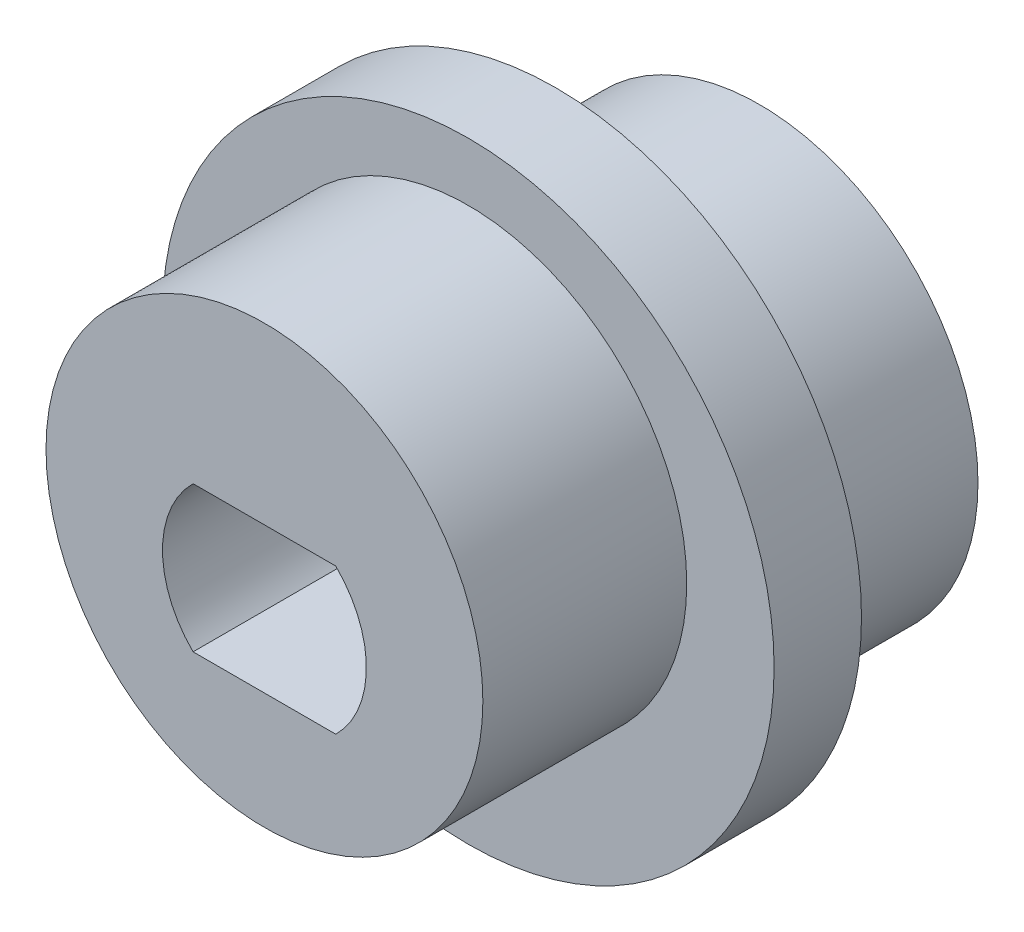
ISO-10303-21;
HEADER;
FILE_DESCRIPTION(('STEP AP214'),'2;1');
FILE_NAME('part.step','',(''),(''),'','','');
FILE_SCHEMA(('AUTOMOTIVE_DESIGN { 1 0 10303 214 1 1 1 1 }'));
ENDSEC;
DATA;
#1=APPLICATION_CONTEXT('core data for automotive mechanical design processes');
#2=APPLICATION_PROTOCOL_DEFINITION('international standard','automotive_design',2000,#1);
#3=PRODUCT_CONTEXT('',#1,'mechanical');
#4=PRODUCT('Part','Part','',(#3));
#5=PRODUCT_RELATED_PRODUCT_CATEGORY('part','',(#4));
#6=PRODUCT_DEFINITION_FORMATION('','',#4);
#7=PRODUCT_DEFINITION_CONTEXT('part definition',#1,'design');
#8=PRODUCT_DEFINITION('design','',#6,#7);
#9=PRODUCT_DEFINITION_SHAPE('','',#8);
#10=(LENGTH_UNIT() NAMED_UNIT(*) SI_UNIT(.MILLI.,.METRE.));
#11=(NAMED_UNIT(*) PLANE_ANGLE_UNIT() SI_UNIT($,.RADIAN.));
#12=(NAMED_UNIT(*) SI_UNIT($,.STERADIAN.) SOLID_ANGLE_UNIT());
#13=UNCERTAINTY_MEASURE_WITH_UNIT(LENGTH_MEASURE(1.E-05),#10,'distance_accuracy_value','');
#14=(GEOMETRIC_REPRESENTATION_CONTEXT(3) GLOBAL_UNCERTAINTY_ASSIGNED_CONTEXT((#13)) GLOBAL_UNIT_ASSIGNED_CONTEXT((#10,
#11,#12)) REPRESENTATION_CONTEXT('',''));
#15=CARTESIAN_POINT('',(0.,0.,0.));
#16=DIRECTION('',(0.,0.,1.));
#17=DIRECTION('',(1.,0.,0.));
#18=AXIS2_PLACEMENT_3D('',#15,#16,#17);
#19=CARTESIAN_POINT('',(0.,0.,0.));
#20=DIRECTION('',(0.,0.,1.));
#21=DIRECTION('',(1.,0.,0.));
#22=AXIS2_PLACEMENT_3D('',#19,#20,#21);
#23=PLANE('',#22);
#24=CARTESIAN_POINT('',(0.,0.,0.));
#25=DIRECTION('',(0.,0.,1.));
#26=DIRECTION('',(1.,0.,0.));
#27=AXIS2_PLACEMENT_3D('',#24,#25,#26);
#28=CIRCLE('',#27,7.5);
#29=CARTESIAN_POINT('',(7.5,0.,0.));
#30=VERTEX_POINT('',#29);
#31=EDGE_CURVE('E50',#30,#30,#28,.T.);
#32=ORIENTED_EDGE('',*,*,#31,.F.);
#33=EDGE_LOOP('',(#32));
#34=FACE_BOUND('',#33,.T.);
#35=DIRECTION('',(1.,0.,0.));
#36=VECTOR('',#35,1.);
#37=CARTESIAN_POINT('',(-2.44948974278318,3.5,0.));
#38=LINE('',#37,#36);
#39=CARTESIAN_POINT('',(-2.44948974278318,3.5,0.));
#40=VERTEX_POINT('',#39);
#41=CARTESIAN_POINT('',(2.44948974278318,3.5,0.));
#42=VERTEX_POINT('',#41);
#43=EDGE_CURVE('E90',#40,#42,#38,.T.);
#44=ORIENTED_EDGE('',*,*,#43,.F.);
#45=CARTESIAN_POINT('',(0.,1.,0.));
#46=DIRECTION('',(0.,0.,1.));
#47=DIRECTION('',(1.,0.,0.));
#48=AXIS2_PLACEMENT_3D('',#45,#46,#47);
#49=CIRCLE('',#48,3.5);
#50=CARTESIAN_POINT('',(-2.44948974278318,-1.5,0.));
#51=VERTEX_POINT('',#50);
#52=EDGE_CURVE('E131',#40,#51,#49,.T.);
#53=ORIENTED_EDGE('',*,*,#52,.T.);
#54=DIRECTION('',(1.,0.,0.));
#55=VECTOR('',#54,1.);
#56=CARTESIAN_POINT('',(-2.44948974278318,-1.5,0.));
#57=LINE('',#56,#55);
#58=CARTESIAN_POINT('',(2.44948974278318,-1.5,0.));
#59=VERTEX_POINT('',#58);
#60=EDGE_CURVE('E62',#51,#59,#57,.T.);
#61=ORIENTED_EDGE('',*,*,#60,.T.);
#62=CARTESIAN_POINT('',(0.,1.,0.));
#63=DIRECTION('',(0.,0.,1.));
#64=DIRECTION('',(1.,0.,0.));
#65=AXIS2_PLACEMENT_3D('',#62,#63,#64);
#66=CIRCLE('',#65,3.5);
#67=EDGE_CURVE('E126',#59,#42,#66,.T.);
#68=ORIENTED_EDGE('',*,*,#67,.T.);
#69=EDGE_LOOP('',(#44,#53,#61,#68));
#70=FACE_BOUND('',#69,.T.);
#71=ADVANCED_FACE('F46',(#34,#70),#23,.F.);
#72=CARTESIAN_POINT('',(0.,2.,17.));
#73=DIRECTION('',(0.,0.,1.));
#74=DIRECTION('',(1.,0.,0.));
#75=AXIS2_PLACEMENT_3D('',#72,#73,#74);
#76=PLANE('',#75);
#77=CARTESIAN_POINT('',(0.,2.,17.));
#78=DIRECTION('',(0.,0.,1.));
#79=DIRECTION('',(1.,0.,0.));
#80=AXIS2_PLACEMENT_3D('',#77,#78,#79);
#81=CIRCLE('',#80,7.5);
#82=CARTESIAN_POINT('',(7.5,2.,17.));
#83=VERTEX_POINT('',#82);
#84=EDGE_CURVE('E143',#83,#83,#81,.T.);
#85=ORIENTED_EDGE('',*,*,#84,.T.);
#86=EDGE_LOOP('',(#85));
#87=FACE_BOUND('',#86,.T.);
#88=CARTESIAN_POINT('',(0.,1.,17.));
#89=DIRECTION('',(0.,0.,1.));
#90=DIRECTION('',(1.,0.,0.));
#91=AXIS2_PLACEMENT_3D('',#88,#89,#90);
#92=CIRCLE('',#91,3.5);
#93=CARTESIAN_POINT('',(-2.44948974278318,3.5,17.));
#94=VERTEX_POINT('',#93);
#95=CARTESIAN_POINT('',(-2.44948974278318,-1.5,17.));
#96=VERTEX_POINT('',#95);
#97=EDGE_CURVE('E110',#94,#96,#92,.T.);
#98=ORIENTED_EDGE('',*,*,#97,.F.);
#99=DIRECTION('',(1.,0.,0.));
#100=VECTOR('',#99,1.);
#101=CARTESIAN_POINT('',(-2.44948974278318,3.5,17.));
#102=LINE('',#101,#100);
#103=CARTESIAN_POINT('',(2.44948974278318,3.5,17.));
#104=VERTEX_POINT('',#103);
#105=EDGE_CURVE('E70',#94,#104,#102,.T.);
#106=ORIENTED_EDGE('',*,*,#105,.T.);
#107=CARTESIAN_POINT('',(0.,1.,17.));
#108=DIRECTION('',(0.,0.,1.));
#109=DIRECTION('',(1.,0.,0.));
#110=AXIS2_PLACEMENT_3D('',#107,#108,#109);
#111=CIRCLE('',#110,3.5);
#112=CARTESIAN_POINT('',(2.44948974278318,-1.5,17.));
#113=VERTEX_POINT('',#112);
#114=EDGE_CURVE('E99',#113,#104,#111,.T.);
#115=ORIENTED_EDGE('',*,*,#114,.F.);
#116=DIRECTION('',(1.,0.,0.));
#117=VECTOR('',#116,1.);
#118=CARTESIAN_POINT('',(-2.44948974278318,-1.5,17.));
#119=LINE('',#118,#117);
#120=EDGE_CURVE('E105',#96,#113,#119,.T.);
#121=ORIENTED_EDGE('',*,*,#120,.F.);
#122=EDGE_LOOP('',(#98,#106,#115,#121));
#123=FACE_BOUND('',#122,.T.);
#124=ADVANCED_FACE('F108',(#87,#123),#76,.T.);
#125=CARTESIAN_POINT('',(0.,0.,7.));
#126=DIRECTION('',(0.,0.,-1.));
#127=DIRECTION('',(-1.,0.,0.));
#128=AXIS2_PLACEMENT_3D('',#125,#126,#127);
#129=CYLINDRICAL_SURFACE('',#128,7.5);
#130=CARTESIAN_POINT('',(0.,0.,7.));
#131=DIRECTION('',(0.,0.,1.));
#132=DIRECTION('',(1.,0.,0.));
#133=AXIS2_PLACEMENT_3D('',#130,#131,#132);
#134=CIRCLE('',#133,7.5);
#135=CARTESIAN_POINT('',(7.5,0.,7.));
#136=VERTEX_POINT('',#135);
#137=EDGE_CURVE('E11',#136,#136,#134,.T.);
#138=ORIENTED_EDGE('',*,*,#137,.F.);
#139=EDGE_LOOP('',(#138));
#140=FACE_BOUND('',#139,.T.);
#141=ORIENTED_EDGE('',*,*,#31,.T.);
#142=EDGE_LOOP('',(#141));
#143=FACE_BOUND('',#142,.T.);
#144=ADVANCED_FACE('F48',(#140,#143),#129,.T.);
#145=CARTESIAN_POINT('',(0.,1.,10.));
#146=DIRECTION('',(0.,0.,1.));
#147=DIRECTION('',(1.,0.,0.));
#148=AXIS2_PLACEMENT_3D('',#145,#146,#147);
#149=PLANE('',#148);
#150=CARTESIAN_POINT('',(0.,2.,10.));
#151=DIRECTION('',(0.,0.,1.));
#152=DIRECTION('',(1.,0.,0.));
#153=AXIS2_PLACEMENT_3D('',#150,#151,#152);
#154=CIRCLE('',#153,7.5);
#155=CARTESIAN_POINT('',(7.5,2.,10.));
#156=VERTEX_POINT('',#155);
#157=EDGE_CURVE('E95',#156,#156,#154,.T.);
#158=ORIENTED_EDGE('',*,*,#157,.F.);
#159=EDGE_LOOP('',(#158));
#160=FACE_BOUND('',#159,.T.);
#161=CARTESIAN_POINT('',(0.,1.,10.));
#162=DIRECTION('',(0.,0.,1.));
#163=DIRECTION('',(1.,0.,0.));
#164=AXIS2_PLACEMENT_3D('',#161,#162,#163);
#165=CIRCLE('',#164,10.5);
#166=CARTESIAN_POINT('',(10.5,1.,10.));
#167=VERTEX_POINT('',#166);
#168=EDGE_CURVE('E116',#167,#167,#165,.T.);
#169=ORIENTED_EDGE('',*,*,#168,.T.);
#170=EDGE_LOOP('',(#169));
#171=FACE_BOUND('',#170,.T.);
#172=ADVANCED_FACE('F153',(#160,#171),#149,.T.);
#173=CARTESIAN_POINT('',(0.,1.,7.));
#174=DIRECTION('',(0.,0.,1.));
#175=DIRECTION('',(1.,0.,0.));
#176=AXIS2_PLACEMENT_3D('',#173,#174,#175);
#177=PLANE('',#176);
#178=ORIENTED_EDGE('',*,*,#137,.T.);
#179=EDGE_LOOP('',(#178));
#180=FACE_BOUND('',#179,.T.);
#181=CARTESIAN_POINT('',(0.,1.,7.));
#182=DIRECTION('',(0.,0.,1.));
#183=DIRECTION('',(1.,0.,0.));
#184=AXIS2_PLACEMENT_3D('',#181,#182,#183);
#185=CIRCLE('',#184,10.5);
#186=CARTESIAN_POINT('',(10.5,1.,7.));
#187=VERTEX_POINT('',#186);
#188=EDGE_CURVE('E112',#187,#187,#185,.F.);
#189=ORIENTED_EDGE('',*,*,#188,.T.);
#190=EDGE_LOOP('',(#189));
#191=FACE_BOUND('',#190,.T.);
#192=ADVANCED_FACE('F156',(#180,#191),#177,.F.);
#193=CARTESIAN_POINT('',(0.,2.,17.));
#194=DIRECTION('',(0.,0.,-1.));
#195=DIRECTION('',(-1.,0.,0.));
#196=AXIS2_PLACEMENT_3D('',#193,#194,#195);
#197=CYLINDRICAL_SURFACE('',#196,7.5);
#198=ORIENTED_EDGE('',*,*,#84,.F.);
#199=EDGE_LOOP('',(#198));
#200=FACE_BOUND('',#199,.T.);
#201=ORIENTED_EDGE('',*,*,#157,.T.);
#202=EDGE_LOOP('',(#201));
#203=FACE_BOUND('',#202,.T.);
#204=ADVANCED_FACE('F151',(#200,#203),#197,.T.);
#205=CARTESIAN_POINT('',(-2.44948974278318,3.5,0.));
#206=DIRECTION('',(0.,-1.,0.));
#207=DIRECTION('',(0.,0.,-1.));
#208=AXIS2_PLACEMENT_3D('',#205,#206,#207);
#209=PLANE('',#208);
#210=DIRECTION('',(0.,0.,1.));
#211=VECTOR('',#210,1.);
#212=CARTESIAN_POINT('',(-2.44948974278318,3.5,0.));
#213=LINE('',#212,#211);
#214=EDGE_CURVE('E135',#40,#94,#213,.T.);
#215=ORIENTED_EDGE('',*,*,#214,.F.);
#216=ORIENTED_EDGE('',*,*,#43,.T.);
#217=DIRECTION('',(0.,0.,1.));
#218=VECTOR('',#217,1.);
#219=CARTESIAN_POINT('',(2.44948974278318,3.5,0.));
#220=LINE('',#219,#218);
#221=EDGE_CURVE('E86',#42,#104,#220,.T.);
#222=ORIENTED_EDGE('',*,*,#221,.T.);
#223=ORIENTED_EDGE('',*,*,#105,.F.);
#224=EDGE_LOOP('',(#215,#216,#222,#223));
#225=FACE_BOUND('',#224,.T.);
#226=ADVANCED_FACE('F88',(#225),#209,.T.);
#227=CARTESIAN_POINT('',(0.,1.,0.));
#228=DIRECTION('',(0.,0.,1.));
#229=DIRECTION('',(1.,0.,0.));
#230=AXIS2_PLACEMENT_3D('',#227,#228,#229);
#231=CYLINDRICAL_SURFACE('',#230,3.5);
#232=ORIENTED_EDGE('',*,*,#221,.F.);
#233=ORIENTED_EDGE('',*,*,#67,.F.);
#234=DIRECTION('',(0.,0.,1.));
#235=VECTOR('',#234,1.);
#236=CARTESIAN_POINT('',(2.44948974278318,-1.5,0.));
#237=LINE('',#236,#235);
#238=EDGE_CURVE('E96',#59,#113,#237,.T.);
#239=ORIENTED_EDGE('',*,*,#238,.T.);
#240=ORIENTED_EDGE('',*,*,#114,.T.);
#241=EDGE_LOOP('',(#232,#233,#239,#240));
#242=FACE_BOUND('',#241,.T.);
#243=ADVANCED_FACE('F100',(#242),#231,.F.);
#244=CARTESIAN_POINT('',(-2.44948974278318,-1.5,0.));
#245=DIRECTION('',(0.,-1.,0.));
#246=DIRECTION('',(0.,0.,-1.));
#247=AXIS2_PLACEMENT_3D('',#244,#245,#246);
#248=PLANE('',#247);
#249=ORIENTED_EDGE('',*,*,#238,.F.);
#250=ORIENTED_EDGE('',*,*,#60,.F.);
#251=DIRECTION('',(0.,0.,1.));
#252=VECTOR('',#251,1.);
#253=CARTESIAN_POINT('',(-2.44948974278318,-1.5,0.));
#254=LINE('',#253,#252);
#255=EDGE_CURVE('E138',#51,#96,#254,.T.);
#256=ORIENTED_EDGE('',*,*,#255,.T.);
#257=ORIENTED_EDGE('',*,*,#120,.T.);
#258=EDGE_LOOP('',(#249,#250,#256,#257));
#259=FACE_BOUND('',#258,.T.);
#260=ADVANCED_FACE('F171',(#259),#248,.F.);
#261=CARTESIAN_POINT('',(0.,1.,0.));
#262=DIRECTION('',(0.,0.,1.));
#263=DIRECTION('',(1.,0.,0.));
#264=AXIS2_PLACEMENT_3D('',#261,#262,#263);
#265=CYLINDRICAL_SURFACE('',#264,3.5);
#266=ORIENTED_EDGE('',*,*,#255,.F.);
#267=ORIENTED_EDGE('',*,*,#52,.F.);
#268=ORIENTED_EDGE('',*,*,#214,.T.);
#269=ORIENTED_EDGE('',*,*,#97,.T.);
#270=EDGE_LOOP('',(#266,#267,#268,#269));
#271=FACE_BOUND('',#270,.T.);
#272=ADVANCED_FACE('F164',(#271),#265,.F.);
#273=CARTESIAN_POINT('',(0.,1.,-22.698484809835));
#274=DIRECTION('',(0.,0.,1.));
#275=DIRECTION('',(1.,0.,0.));
#276=AXIS2_PLACEMENT_3D('',#273,#274,#275);
#277=CYLINDRICAL_SURFACE('',#276,10.5);
#278=ORIENTED_EDGE('',*,*,#188,.F.);
#279=EDGE_LOOP('',(#278));
#280=FACE_BOUND('',#279,.T.);
#281=ORIENTED_EDGE('',*,*,#168,.F.);
#282=EDGE_LOOP('',(#281));
#283=FACE_BOUND('',#282,.T.);
#284=ADVANCED_FACE('F162',(#280,#283),#277,.T.);
#285=CLOSED_SHELL('',(#71,#124,#144,#172,#192,#204,#226,#243,#260,#272,#284));
#286=MANIFOLD_SOLID_BREP('B2',#285);
#287=ADVANCED_BREP_SHAPE_REPRESENTATION('',(#18,#286),#14);
#288=SHAPE_DEFINITION_REPRESENTATION(#9,#287);
ENDSEC;
END-ISO-10303-21;
